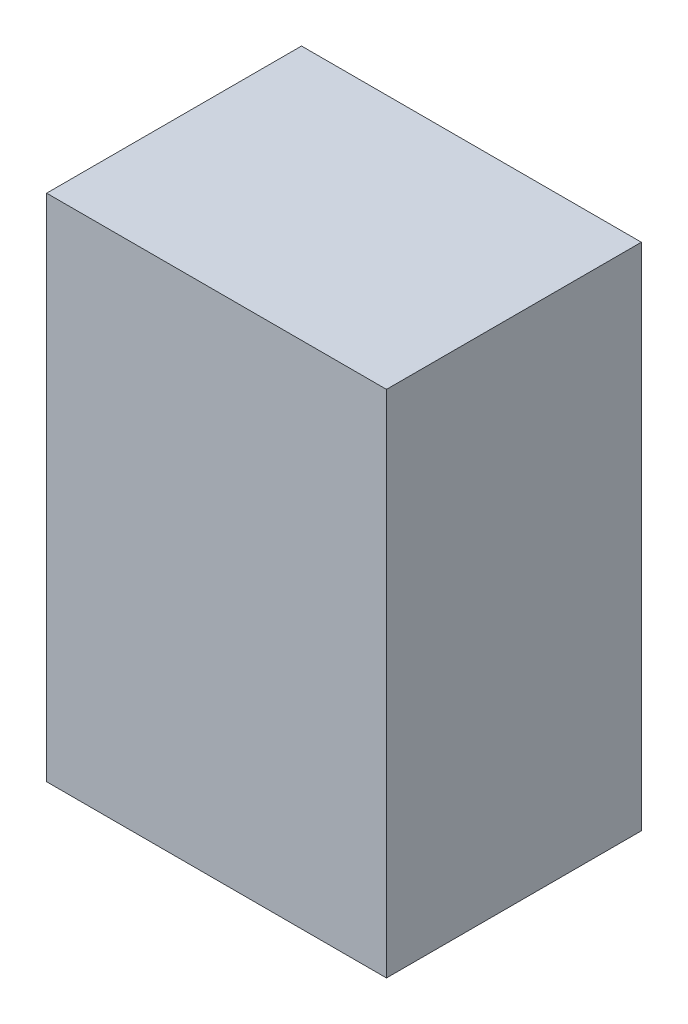
ISO-10303-21;
HEADER;
FILE_DESCRIPTION(('STEP AP214'),'2;1');
FILE_NAME('part.step','',(''),(''),'','','');
FILE_SCHEMA(('AUTOMOTIVE_DESIGN { 1 0 10303 214 1 1 1 1 }'));
ENDSEC;
DATA;
#1=APPLICATION_CONTEXT('core data for automotive mechanical design processes');
#2=APPLICATION_PROTOCOL_DEFINITION('international standard','automotive_design',2000,#1);
#3=PRODUCT_CONTEXT('',#1,'mechanical');
#4=PRODUCT('Part','Part','',(#3));
#5=PRODUCT_RELATED_PRODUCT_CATEGORY('part','',(#4));
#6=PRODUCT_DEFINITION_FORMATION('','',#4);
#7=PRODUCT_DEFINITION_CONTEXT('part definition',#1,'design');
#8=PRODUCT_DEFINITION('design','',#6,#7);
#9=PRODUCT_DEFINITION_SHAPE('','',#8);
#10=(LENGTH_UNIT() NAMED_UNIT(*) SI_UNIT(.MILLI.,.METRE.));
#11=(NAMED_UNIT(*) PLANE_ANGLE_UNIT() SI_UNIT($,.RADIAN.));
#12=(NAMED_UNIT(*) SI_UNIT($,.STERADIAN.) SOLID_ANGLE_UNIT());
#13=UNCERTAINTY_MEASURE_WITH_UNIT(LENGTH_MEASURE(1.E-05),#10,'distance_accuracy_value','');
#14=(GEOMETRIC_REPRESENTATION_CONTEXT(3) GLOBAL_UNCERTAINTY_ASSIGNED_CONTEXT((#13)) GLOBAL_UNIT_ASSIGNED_CONTEXT((#10,
#11,#12)) REPRESENTATION_CONTEXT('',''));
#15=CARTESIAN_POINT('',(0.,0.,0.));
#16=DIRECTION('',(0.,0.,1.));
#17=DIRECTION('',(1.,0.,0.));
#18=AXIS2_PLACEMENT_3D('',#15,#16,#17);
#19=CARTESIAN_POINT('',(0.,120.,0.));
#20=DIRECTION('',(-1.,0.,0.));
#21=DIRECTION('',(0.,0.,1.));
#22=AXIS2_PLACEMENT_3D('',#19,#20,#21);
#23=PLANE('',#22);
#24=DIRECTION('',(0.,0.,-1.));
#25=VECTOR('',#24,1.);
#26=CARTESIAN_POINT('',(0.,0.,0.));
#27=LINE('',#26,#25);
#28=CARTESIAN_POINT('',(0.,0.,0.));
#29=VERTEX_POINT('',#28);
#30=CARTESIAN_POINT('',(0.,0.,-60.));
#31=VERTEX_POINT('',#30);
#32=EDGE_CURVE('E75',#29,#31,#27,.T.);
#33=ORIENTED_EDGE('',*,*,#32,.T.);
#34=DIRECTION('',(0.,-1.,0.));
#35=VECTOR('',#34,1.);
#36=CARTESIAN_POINT('',(0.,120.,-60.));
#37=LINE('',#36,#35);
#38=CARTESIAN_POINT('',(0.,120.,-60.));
#39=VERTEX_POINT('',#38);
#40=EDGE_CURVE('E11',#39,#31,#37,.T.);
#41=ORIENTED_EDGE('',*,*,#40,.F.);
#42=DIRECTION('',(0.,0.,-1.));
#43=VECTOR('',#42,1.);
#44=CARTESIAN_POINT('',(0.,120.,0.));
#45=LINE('',#44,#43);
#46=CARTESIAN_POINT('',(0.,120.,0.));
#47=VERTEX_POINT('',#46);
#48=EDGE_CURVE('E93',#47,#39,#45,.T.);
#49=ORIENTED_EDGE('',*,*,#48,.F.);
#50=DIRECTION('',(0.,-1.,0.));
#51=VECTOR('',#50,1.);
#52=CARTESIAN_POINT('',(0.,120.,0.));
#53=LINE('',#52,#51);
#54=EDGE_CURVE('E87',#47,#29,#53,.T.);
#55=ORIENTED_EDGE('',*,*,#54,.T.);
#56=EDGE_LOOP('',(#33,#41,#49,#55));
#57=FACE_BOUND('',#56,.T.);
#58=ADVANCED_FACE('F31',(#57),#23,.F.);
#59=CARTESIAN_POINT('',(0.,120.,-60.));
#60=DIRECTION('',(0.,0.,1.));
#61=DIRECTION('',(1.,0.,0.));
#62=AXIS2_PLACEMENT_3D('',#59,#60,#61);
#63=PLANE('',#62);
#64=DIRECTION('',(-1.,0.,0.));
#65=VECTOR('',#64,1.);
#66=CARTESIAN_POINT('',(0.,0.,-60.));
#67=LINE('',#66,#65);
#68=CARTESIAN_POINT('',(-80.,0.,-60.));
#69=VERTEX_POINT('',#68);
#70=EDGE_CURVE('E71',#31,#69,#67,.T.);
#71=ORIENTED_EDGE('',*,*,#70,.T.);
#72=DIRECTION('',(0.,-1.,0.));
#73=VECTOR('',#72,1.);
#74=CARTESIAN_POINT('',(-80.,120.,-60.));
#75=LINE('',#74,#73);
#76=CARTESIAN_POINT('',(-80.,120.,-60.));
#77=VERTEX_POINT('',#76);
#78=EDGE_CURVE('E38',#77,#69,#75,.T.);
#79=ORIENTED_EDGE('',*,*,#78,.F.);
#80=DIRECTION('',(-1.,0.,0.));
#81=VECTOR('',#80,1.);
#82=CARTESIAN_POINT('',(0.,120.,-60.));
#83=LINE('',#82,#81);
#84=EDGE_CURVE('E83',#39,#77,#83,.T.);
#85=ORIENTED_EDGE('',*,*,#84,.F.);
#86=ORIENTED_EDGE('',*,*,#40,.T.);
#87=EDGE_LOOP('',(#71,#79,#85,#86));
#88=FACE_BOUND('',#87,.T.);
#89=ADVANCED_FACE('F82',(#88),#63,.F.);
#90=CARTESIAN_POINT('',(-80.,120.,0.));
#91=DIRECTION('',(1.,0.,0.));
#92=DIRECTION('',(0.,0.,-1.));
#93=AXIS2_PLACEMENT_3D('',#90,#91,#92);
#94=PLANE('',#93);
#95=DIRECTION('',(0.,0.,1.));
#96=VECTOR('',#95,1.);
#97=CARTESIAN_POINT('',(-80.,0.,0.));
#98=LINE('',#97,#96);
#99=CARTESIAN_POINT('',(-80.,0.,0.));
#100=VERTEX_POINT('',#99);
#101=EDGE_CURVE('E76',#69,#100,#98,.T.);
#102=ORIENTED_EDGE('',*,*,#101,.T.);
#103=DIRECTION('',(0.,-1.,0.));
#104=VECTOR('',#103,1.);
#105=CARTESIAN_POINT('',(-80.,120.,0.));
#106=LINE('',#105,#104);
#107=CARTESIAN_POINT('',(-80.,120.,0.));
#108=VERTEX_POINT('',#107);
#109=EDGE_CURVE('E99',#108,#100,#106,.T.);
#110=ORIENTED_EDGE('',*,*,#109,.F.);
#111=DIRECTION('',(0.,0.,1.));
#112=VECTOR('',#111,1.);
#113=CARTESIAN_POINT('',(-80.,120.,0.));
#114=LINE('',#113,#112);
#115=EDGE_CURVE('E50',#77,#108,#114,.T.);
#116=ORIENTED_EDGE('',*,*,#115,.F.);
#117=ORIENTED_EDGE('',*,*,#78,.T.);
#118=EDGE_LOOP('',(#102,#110,#116,#117));
#119=FACE_BOUND('',#118,.T.);
#120=ADVANCED_FACE('F102',(#119),#94,.F.);
#121=CARTESIAN_POINT('',(0.,120.,0.));
#122=DIRECTION('',(0.,0.,-1.));
#123=DIRECTION('',(-1.,0.,0.));
#124=AXIS2_PLACEMENT_3D('',#121,#122,#123);
#125=PLANE('',#124);
#126=DIRECTION('',(1.,0.,0.));
#127=VECTOR('',#126,1.);
#128=CARTESIAN_POINT('',(0.,0.,0.));
#129=LINE('',#128,#127);
#130=EDGE_CURVE('E91',#100,#29,#129,.T.);
#131=ORIENTED_EDGE('',*,*,#130,.T.);
#132=ORIENTED_EDGE('',*,*,#54,.F.);
#133=DIRECTION('',(1.,0.,0.));
#134=VECTOR('',#133,1.);
#135=CARTESIAN_POINT('',(0.,120.,0.));
#136=LINE('',#135,#134);
#137=EDGE_CURVE('E45',#108,#47,#136,.T.);
#138=ORIENTED_EDGE('',*,*,#137,.F.);
#139=ORIENTED_EDGE('',*,*,#109,.T.);
#140=EDGE_LOOP('',(#131,#132,#138,#139));
#141=FACE_BOUND('',#140,.T.);
#142=ADVANCED_FACE('F104',(#141),#125,.F.);
#143=CARTESIAN_POINT('',(0.,120.,-60.));
#144=DIRECTION('',(0.,1.,0.));
#145=DIRECTION('',(0.,0.,1.));
#146=AXIS2_PLACEMENT_3D('',#143,#144,#145);
#147=PLANE('',#146);
#148=ORIENTED_EDGE('',*,*,#48,.T.);
#149=ORIENTED_EDGE('',*,*,#84,.T.);
#150=ORIENTED_EDGE('',*,*,#115,.T.);
#151=ORIENTED_EDGE('',*,*,#137,.T.);
#152=EDGE_LOOP('',(#148,#149,#150,#151));
#153=FACE_BOUND('',#152,.T.);
#154=ADVANCED_FACE('F105',(#153),#147,.T.);
#155=CARTESIAN_POINT('',(0.,0.,-60.));
#156=DIRECTION('',(0.,1.,0.));
#157=DIRECTION('',(0.,0.,1.));
#158=AXIS2_PLACEMENT_3D('',#155,#156,#157);
#159=PLANE('',#158);
#160=ORIENTED_EDGE('',*,*,#32,.F.);
#161=ORIENTED_EDGE('',*,*,#130,.F.);
#162=ORIENTED_EDGE('',*,*,#101,.F.);
#163=ORIENTED_EDGE('',*,*,#70,.F.);
#164=EDGE_LOOP('',(#160,#161,#162,#163));
#165=FACE_BOUND('',#164,.T.);
#166=ADVANCED_FACE('F72',(#165),#159,.F.);
#167=CLOSED_SHELL('',(#58,#89,#120,#142,#154,#166));
#168=MANIFOLD_SOLID_BREP('B2',#167);
#169=ADVANCED_BREP_SHAPE_REPRESENTATION('',(#18,#168),#14);
#170=SHAPE_DEFINITION_REPRESENTATION(#9,#169);
ENDSEC;
END-ISO-10303-21;
